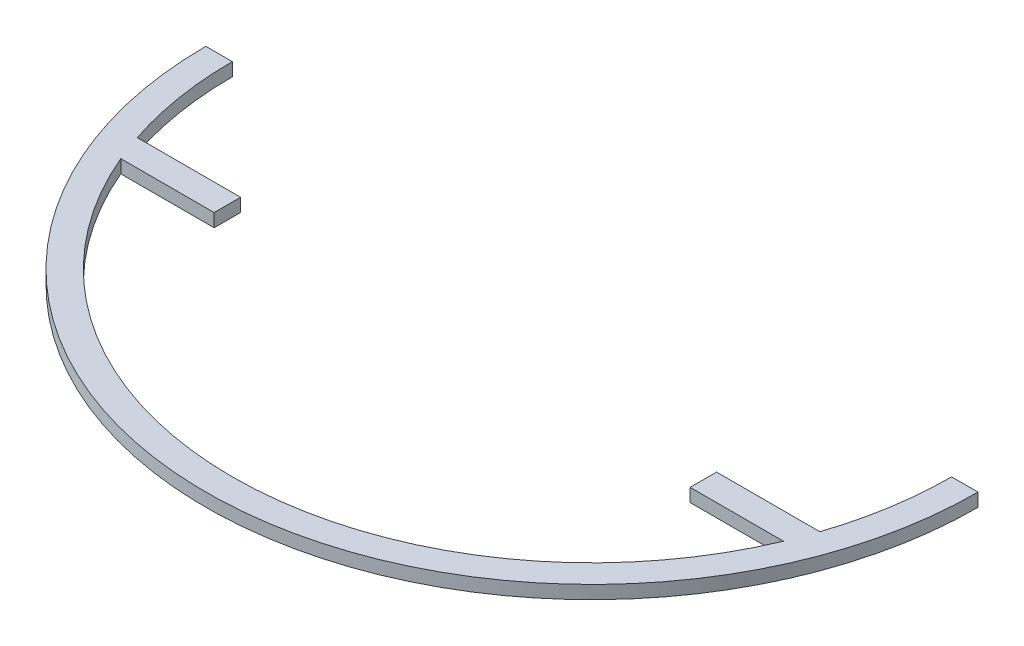
ISO-10303-21;
HEADER;
FILE_DESCRIPTION(('STEP AP214'),'2;1');
FILE_NAME('part.step','',(''),(''),'','','');
FILE_SCHEMA(('AUTOMOTIVE_DESIGN { 1 0 10303 214 1 1 1 1 }'));
ENDSEC;
DATA;
#1=APPLICATION_CONTEXT('core data for automotive mechanical design processes');
#2=APPLICATION_PROTOCOL_DEFINITION('international standard','automotive_design',2000,#1);
#3=PRODUCT_CONTEXT('',#1,'mechanical');
#4=PRODUCT('Part','Part','',(#3));
#5=PRODUCT_RELATED_PRODUCT_CATEGORY('part','',(#4));
#6=PRODUCT_DEFINITION_FORMATION('','',#4);
#7=PRODUCT_DEFINITION_CONTEXT('part definition',#1,'design');
#8=PRODUCT_DEFINITION('design','',#6,#7);
#9=PRODUCT_DEFINITION_SHAPE('','',#8);
#10=(LENGTH_UNIT() NAMED_UNIT(*) SI_UNIT(.MILLI.,.METRE.));
#11=(NAMED_UNIT(*) PLANE_ANGLE_UNIT() SI_UNIT($,.RADIAN.));
#12=(NAMED_UNIT(*) SI_UNIT($,.STERADIAN.) SOLID_ANGLE_UNIT());
#13=UNCERTAINTY_MEASURE_WITH_UNIT(LENGTH_MEASURE(1.E-05),#10,'distance_accuracy_value','');
#14=(GEOMETRIC_REPRESENTATION_CONTEXT(3) GLOBAL_UNCERTAINTY_ASSIGNED_CONTEXT((#13)) GLOBAL_UNIT_ASSIGNED_CONTEXT((#10,
#11,#12)) REPRESENTATION_CONTEXT('',''));
#15=CARTESIAN_POINT('',(0.,0.,0.));
#16=DIRECTION('',(0.,0.,1.));
#17=DIRECTION('',(1.,0.,0.));
#18=AXIS2_PLACEMENT_3D('',#15,#16,#17);
#19=CARTESIAN_POINT('',(0.,3.175,27.2204316815419));
#20=DIRECTION('',(0.,0.,-1.));
#21=DIRECTION('',(-1.,0.,0.));
#22=AXIS2_PLACEMENT_3D('',#19,#20,#21);
#23=PLANE('',#22);
#24=DIRECTION('',(1.,0.,0.));
#25=VECTOR('',#24,1.);
#26=CARTESIAN_POINT('',(0.,0.,27.2204316815419));
#27=LINE('',#26,#25);
#28=CARTESIAN_POINT('',(-81.9579019928556,0.,27.2204316815419));
#29=VERTEX_POINT('',#28);
#30=CARTESIAN_POINT('',(-57.15,0.,27.2204316815419));
#31=VERTEX_POINT('',#30);
#32=EDGE_CURVE('E197',#29,#31,#27,.T.);
#33=ORIENTED_EDGE('',*,*,#32,.F.);
#34=DIRECTION('',(0.,-1.,0.));
#35=VECTOR('',#34,1.);
#36=CARTESIAN_POINT('',(-81.9579019928556,3.175,27.2204316815419));
#37=LINE('',#36,#35);
#38=CARTESIAN_POINT('',(-81.9579019928556,3.175,27.2204316815419));
#39=VERTEX_POINT('',#38);
#40=EDGE_CURVE('E11',#39,#29,#37,.T.);
#41=ORIENTED_EDGE('',*,*,#40,.F.);
#42=DIRECTION('',(1.,0.,0.));
#43=VECTOR('',#42,1.);
#44=CARTESIAN_POINT('',(0.,3.175,27.2204316815419));
#45=LINE('',#44,#43);
#46=CARTESIAN_POINT('',(-57.15,3.175,27.2204316815419));
#47=VERTEX_POINT('',#46);
#48=EDGE_CURVE('E159',#39,#47,#45,.T.);
#49=ORIENTED_EDGE('',*,*,#48,.T.);
#50=DIRECTION('',(0.,-1.,0.));
#51=VECTOR('',#50,1.);
#52=CARTESIAN_POINT('',(-57.15,3.175,27.2204316815419));
#53=LINE('',#52,#51);
#54=EDGE_CURVE('E51',#47,#31,#53,.T.);
#55=ORIENTED_EDGE('',*,*,#54,.T.);
#56=EDGE_LOOP('',(#33,#41,#49,#55));
#57=FACE_BOUND('',#56,.T.);
#58=ADVANCED_FACE('F35',(#57),#23,.T.);
#59=CARTESIAN_POINT('',(0.,3.175,0.));
#60=DIRECTION('',(0.,-1.,0.));
#61=DIRECTION('',(0.,0.,-1.));
#62=AXIS2_PLACEMENT_3D('',#59,#60,#61);
#63=CYLINDRICAL_SURFACE('',#62,86.36);
#64=CARTESIAN_POINT('',(0.,0.,0.));
#65=DIRECTION('',(0.,1.,0.));
#66=DIRECTION('',(0.,0.,1.));
#67=AXIS2_PLACEMENT_3D('',#64,#65,#66);
#68=CIRCLE('',#67,86.36);
#69=CARTESIAN_POINT('',(-86.36,0.,0.));
#70=VERTEX_POINT('',#69);
#71=EDGE_CURVE('E195',#70,#29,#68,.T.);
#72=ORIENTED_EDGE('',*,*,#71,.F.);
#73=DIRECTION('',(0.,-1.,0.));
#74=VECTOR('',#73,1.);
#75=CARTESIAN_POINT('',(-86.36,3.175,0.));
#76=LINE('',#75,#74);
#77=CARTESIAN_POINT('',(-86.36,3.175,0.));
#78=VERTEX_POINT('',#77);
#79=EDGE_CURVE('E43',#78,#70,#76,.T.);
#80=ORIENTED_EDGE('',*,*,#79,.F.);
#81=CARTESIAN_POINT('',(0.,3.175,0.));
#82=DIRECTION('',(0.,1.,0.));
#83=DIRECTION('',(0.,0.,1.));
#84=AXIS2_PLACEMENT_3D('',#81,#82,#83);
#85=CIRCLE('',#84,86.36);
#86=EDGE_CURVE('E149',#78,#39,#85,.T.);
#87=ORIENTED_EDGE('',*,*,#86,.T.);
#88=ORIENTED_EDGE('',*,*,#40,.T.);
#89=EDGE_LOOP('',(#72,#80,#87,#88));
#90=FACE_BOUND('',#89,.T.);
#91=ADVANCED_FACE('F196',(#90),#63,.F.);
#92=CARTESIAN_POINT('',(0.,3.175,0.));
#93=DIRECTION('',(0.,0.,-1.));
#94=DIRECTION('',(-1.,0.,0.));
#95=AXIS2_PLACEMENT_3D('',#92,#93,#94);
#96=PLANE('',#95);
#97=DIRECTION('',(1.,0.,0.));
#98=VECTOR('',#97,1.);
#99=CARTESIAN_POINT('',(0.,0.,0.));
#100=LINE('',#99,#98);
#101=CARTESIAN_POINT('',(-92.71,0.,0.));
#102=VERTEX_POINT('',#101);
#103=EDGE_CURVE('E192',#102,#70,#100,.T.);
#104=ORIENTED_EDGE('',*,*,#103,.F.);
#105=DIRECTION('',(0.,-1.,0.));
#106=VECTOR('',#105,1.);
#107=CARTESIAN_POINT('',(-92.71,3.175,0.));
#108=LINE('',#107,#106);
#109=CARTESIAN_POINT('',(-92.71,3.175,0.));
#110=VERTEX_POINT('',#109);
#111=EDGE_CURVE('E186',#110,#102,#108,.T.);
#112=ORIENTED_EDGE('',*,*,#111,.F.);
#113=DIRECTION('',(1.,0.,0.));
#114=VECTOR('',#113,1.);
#115=CARTESIAN_POINT('',(0.,3.175,0.));
#116=LINE('',#115,#114);
#117=EDGE_CURVE('E158',#110,#78,#116,.T.);
#118=ORIENTED_EDGE('',*,*,#117,.T.);
#119=ORIENTED_EDGE('',*,*,#79,.T.);
#120=EDGE_LOOP('',(#104,#112,#118,#119));
#121=FACE_BOUND('',#120,.T.);
#122=ADVANCED_FACE('F190',(#121),#96,.T.);
#123=CARTESIAN_POINT('',(0.,3.175,0.));
#124=DIRECTION('',(0.,-1.,0.));
#125=DIRECTION('',(0.,0.,-1.));
#126=AXIS2_PLACEMENT_3D('',#123,#124,#125);
#127=CYLINDRICAL_SURFACE('',#126,92.71);
#128=CARTESIAN_POINT('',(0.,0.,0.));
#129=DIRECTION('',(0.,1.,0.));
#130=DIRECTION('',(0.,0.,1.));
#131=AXIS2_PLACEMENT_3D('',#128,#129,#130);
#132=CIRCLE('',#131,92.71);
#133=CARTESIAN_POINT('',(92.71,0.,0.));
#134=VERTEX_POINT('',#133);
#135=EDGE_CURVE('E204',#102,#134,#132,.T.);
#136=ORIENTED_EDGE('',*,*,#135,.T.);
#137=DIRECTION('',(0.,-1.,0.));
#138=VECTOR('',#137,1.);
#139=CARTESIAN_POINT('',(92.71,3.175,0.));
#140=LINE('',#139,#138);
#141=CARTESIAN_POINT('',(92.71,3.175,0.));
#142=VERTEX_POINT('',#141);
#143=EDGE_CURVE('E184',#142,#134,#140,.T.);
#144=ORIENTED_EDGE('',*,*,#143,.F.);
#145=CARTESIAN_POINT('',(0.,3.175,0.));
#146=DIRECTION('',(0.,1.,0.));
#147=DIRECTION('',(0.,0.,1.));
#148=AXIS2_PLACEMENT_3D('',#145,#146,#147);
#149=CIRCLE('',#148,92.71);
#150=EDGE_CURVE('E163',#110,#142,#149,.T.);
#151=ORIENTED_EDGE('',*,*,#150,.F.);
#152=ORIENTED_EDGE('',*,*,#111,.T.);
#153=EDGE_LOOP('',(#136,#144,#151,#152));
#154=FACE_BOUND('',#153,.T.);
#155=ADVANCED_FACE('F234',(#154),#127,.T.);
#156=CARTESIAN_POINT('',(0.,3.175,0.));
#157=DIRECTION('',(0.,0.,-1.));
#158=DIRECTION('',(-1.,0.,0.));
#159=AXIS2_PLACEMENT_3D('',#156,#157,#158);
#160=PLANE('',#159);
#161=DIRECTION('',(1.,0.,0.));
#162=VECTOR('',#161,1.);
#163=CARTESIAN_POINT('',(0.,0.,0.));
#164=LINE('',#163,#162);
#165=CARTESIAN_POINT('',(86.36,0.,0.));
#166=VERTEX_POINT('',#165);
#167=EDGE_CURVE('E206',#166,#134,#164,.T.);
#168=ORIENTED_EDGE('',*,*,#167,.F.);
#169=DIRECTION('',(0.,-1.,0.));
#170=VECTOR('',#169,1.);
#171=CARTESIAN_POINT('',(86.36,3.175,0.));
#172=LINE('',#171,#170);
#173=CARTESIAN_POINT('',(86.36,3.175,0.));
#174=VERTEX_POINT('',#173);
#175=EDGE_CURVE('E182',#174,#166,#172,.T.);
#176=ORIENTED_EDGE('',*,*,#175,.F.);
#177=DIRECTION('',(1.,0.,0.));
#178=VECTOR('',#177,1.);
#179=CARTESIAN_POINT('',(0.,3.175,0.));
#180=LINE('',#179,#178);
#181=EDGE_CURVE('E156',#174,#142,#180,.T.);
#182=ORIENTED_EDGE('',*,*,#181,.T.);
#183=ORIENTED_EDGE('',*,*,#143,.T.);
#184=EDGE_LOOP('',(#168,#176,#182,#183));
#185=FACE_BOUND('',#184,.T.);
#186=ADVANCED_FACE('F230',(#185),#160,.T.);
#187=CARTESIAN_POINT('',(81.9579019928556,0.,27.2204316815419));
#188=VERTEX_POINT('',#187);
#189=EDGE_CURVE('E199',#188,#166,#68,.T.);
#190=ORIENTED_EDGE('',*,*,#189,.F.);
#191=DIRECTION('',(0.,-1.,0.));
#192=VECTOR('',#191,1.);
#193=CARTESIAN_POINT('',(81.9579019928556,3.175,27.2204316815419));
#194=LINE('',#193,#192);
#195=CARTESIAN_POINT('',(81.9579019928556,3.175,27.2204316815419));
#196=VERTEX_POINT('',#195);
#197=EDGE_CURVE('E180',#196,#188,#194,.T.);
#198=ORIENTED_EDGE('',*,*,#197,.F.);
#199=EDGE_CURVE('E148',#196,#174,#85,.T.);
#200=ORIENTED_EDGE('',*,*,#199,.T.);
#201=ORIENTED_EDGE('',*,*,#175,.T.);
#202=EDGE_LOOP('',(#190,#198,#200,#201));
#203=FACE_BOUND('',#202,.T.);
#204=ADVANCED_FACE('F225',(#203),#63,.F.);
#205=CARTESIAN_POINT('',(0.,3.175,27.2204316815419));
#206=DIRECTION('',(0.,0.,-1.));
#207=DIRECTION('',(-1.,0.,0.));
#208=AXIS2_PLACEMENT_3D('',#205,#206,#207);
#209=PLANE('',#208);
#210=DIRECTION('',(1.,0.,0.));
#211=VECTOR('',#210,1.);
#212=CARTESIAN_POINT('',(0.,0.,27.2204316815419));
#213=LINE('',#212,#211);
#214=CARTESIAN_POINT('',(57.15,0.,27.2204316815419));
#215=VERTEX_POINT('',#214);
#216=EDGE_CURVE('E211',#215,#188,#213,.T.);
#217=ORIENTED_EDGE('',*,*,#216,.F.);
#218=DIRECTION('',(0.,-1.,0.));
#219=VECTOR('',#218,1.);
#220=CARTESIAN_POINT('',(57.15,3.175,27.2204316815419));
#221=LINE('',#220,#219);
#222=CARTESIAN_POINT('',(57.15,3.175,27.2204316815419));
#223=VERTEX_POINT('',#222);
#224=EDGE_CURVE('E178',#223,#215,#221,.T.);
#225=ORIENTED_EDGE('',*,*,#224,.F.);
#226=DIRECTION('',(1.,0.,0.));
#227=VECTOR('',#226,1.);
#228=CARTESIAN_POINT('',(0.,3.175,27.2204316815419));
#229=LINE('',#228,#227);
#230=EDGE_CURVE('E155',#223,#196,#229,.T.);
#231=ORIENTED_EDGE('',*,*,#230,.T.);
#232=ORIENTED_EDGE('',*,*,#197,.T.);
#233=EDGE_LOOP('',(#217,#225,#231,#232));
#234=FACE_BOUND('',#233,.T.);
#235=ADVANCED_FACE('F257',(#234),#209,.T.);
#236=CARTESIAN_POINT('',(57.15,3.175,0.));
#237=DIRECTION('',(1.,0.,0.));
#238=DIRECTION('',(0.,0.,-1.));
#239=AXIS2_PLACEMENT_3D('',#236,#237,#238);
#240=PLANE('',#239);
#241=DIRECTION('',(0.,0.,1.));
#242=VECTOR('',#241,1.);
#243=CARTESIAN_POINT('',(57.15,0.,0.));
#244=LINE('',#243,#242);
#245=CARTESIAN_POINT('',(57.15,0.,33.5704316815419));
#246=VERTEX_POINT('',#245);
#247=EDGE_CURVE('E214',#215,#246,#244,.T.);
#248=ORIENTED_EDGE('',*,*,#247,.T.);
#249=DIRECTION('',(0.,-1.,0.));
#250=VECTOR('',#249,1.);
#251=CARTESIAN_POINT('',(57.15,3.175,33.5704316815419));
#252=LINE('',#251,#250);
#253=CARTESIAN_POINT('',(57.15,3.175,33.5704316815419));
#254=VERTEX_POINT('',#253);
#255=EDGE_CURVE('E175',#254,#246,#252,.T.);
#256=ORIENTED_EDGE('',*,*,#255,.F.);
#257=DIRECTION('',(0.,0.,1.));
#258=VECTOR('',#257,1.);
#259=CARTESIAN_POINT('',(57.15,3.175,0.));
#260=LINE('',#259,#258);
#261=EDGE_CURVE('E150',#223,#254,#260,.T.);
#262=ORIENTED_EDGE('',*,*,#261,.F.);
#263=ORIENTED_EDGE('',*,*,#224,.T.);
#264=EDGE_LOOP('',(#248,#256,#262,#263));
#265=FACE_BOUND('',#264,.T.);
#266=ADVANCED_FACE('F263',(#265),#240,.F.);
#267=CARTESIAN_POINT('',(0.,3.175,33.5704316815419));
#268=DIRECTION('',(0.,0.,-1.));
#269=DIRECTION('',(-1.,0.,0.));
#270=AXIS2_PLACEMENT_3D('',#267,#268,#269);
#271=PLANE('',#270);
#272=DIRECTION('',(1.,0.,0.));
#273=VECTOR('',#272,1.);
#274=CARTESIAN_POINT('',(0.,0.,33.5704316815419));
#275=LINE('',#274,#273);
#276=CARTESIAN_POINT('',(79.5680571379931,0.,33.5704316815419));
#277=VERTEX_POINT('',#276);
#278=EDGE_CURVE('E215',#246,#277,#275,.T.);
#279=ORIENTED_EDGE('',*,*,#278,.T.);
#280=DIRECTION('',(0.,-1.,0.));
#281=VECTOR('',#280,1.);
#282=CARTESIAN_POINT('',(79.5680571379931,3.175,33.5704316815419));
#283=LINE('',#282,#281);
#284=CARTESIAN_POINT('',(79.5680571379931,3.175,33.5704316815419));
#285=VERTEX_POINT('',#284);
#286=EDGE_CURVE('E135',#285,#277,#283,.T.);
#287=ORIENTED_EDGE('',*,*,#286,.F.);
#288=DIRECTION('',(1.,0.,0.));
#289=VECTOR('',#288,1.);
#290=CARTESIAN_POINT('',(0.,3.175,33.5704316815419));
#291=LINE('',#290,#289);
#292=EDGE_CURVE('E145',#254,#285,#291,.T.);
#293=ORIENTED_EDGE('',*,*,#292,.F.);
#294=ORIENTED_EDGE('',*,*,#255,.T.);
#295=EDGE_LOOP('',(#279,#287,#293,#294));
#296=FACE_BOUND('',#295,.T.);
#297=ADVANCED_FACE('F259',(#296),#271,.F.);
#298=CARTESIAN_POINT('',(-79.5680571379931,0.,33.5704316815419));
#299=VERTEX_POINT('',#298);
#300=EDGE_CURVE('E132',#299,#277,#68,.T.);
#301=ORIENTED_EDGE('',*,*,#300,.F.);
#302=DIRECTION('',(0.,-1.,0.));
#303=VECTOR('',#302,1.);
#304=CARTESIAN_POINT('',(-79.5680571379931,3.175,33.5704316815419));
#305=LINE('',#304,#303);
#306=CARTESIAN_POINT('',(-79.5680571379931,3.175,33.5704316815419));
#307=VERTEX_POINT('',#306);
#308=EDGE_CURVE('E126',#307,#299,#305,.T.);
#309=ORIENTED_EDGE('',*,*,#308,.F.);
#310=EDGE_CURVE('E130',#307,#285,#85,.T.);
#311=ORIENTED_EDGE('',*,*,#310,.T.);
#312=ORIENTED_EDGE('',*,*,#286,.T.);
#313=EDGE_LOOP('',(#301,#309,#311,#312));
#314=FACE_BOUND('',#313,.T.);
#315=ADVANCED_FACE('F128',(#314),#63,.F.);
#316=CARTESIAN_POINT('',(0.,3.175,33.5704316815419));
#317=DIRECTION('',(0.,0.,-1.));
#318=DIRECTION('',(-1.,0.,0.));
#319=AXIS2_PLACEMENT_3D('',#316,#317,#318);
#320=PLANE('',#319);
#321=DIRECTION('',(1.,0.,0.));
#322=VECTOR('',#321,1.);
#323=CARTESIAN_POINT('',(0.,0.,33.5704316815419));
#324=LINE('',#323,#322);
#325=CARTESIAN_POINT('',(-57.15,0.,33.5704316815419));
#326=VERTEX_POINT('',#325);
#327=EDGE_CURVE('E166',#299,#326,#324,.T.);
#328=ORIENTED_EDGE('',*,*,#327,.T.);
#329=DIRECTION('',(0.,-1.,0.));
#330=VECTOR('',#329,1.);
#331=CARTESIAN_POINT('',(-57.15,3.175,33.5704316815419));
#332=LINE('',#331,#330);
#333=CARTESIAN_POINT('',(-57.15,3.175,33.5704316815419));
#334=VERTEX_POINT('',#333);
#335=EDGE_CURVE('E89',#334,#326,#332,.T.);
#336=ORIENTED_EDGE('',*,*,#335,.F.);
#337=DIRECTION('',(1.,0.,0.));
#338=VECTOR('',#337,1.);
#339=CARTESIAN_POINT('',(0.,3.175,33.5704316815419));
#340=LINE('',#339,#338);
#341=EDGE_CURVE('E137',#307,#334,#340,.T.);
#342=ORIENTED_EDGE('',*,*,#341,.F.);
#343=ORIENTED_EDGE('',*,*,#308,.T.);
#344=EDGE_LOOP('',(#328,#336,#342,#343));
#345=FACE_BOUND('',#344,.T.);
#346=ADVANCED_FACE('F138',(#345),#320,.F.);
#347=CARTESIAN_POINT('',(-57.15,3.175,0.));
#348=DIRECTION('',(1.,0.,0.));
#349=DIRECTION('',(0.,0.,-1.));
#350=AXIS2_PLACEMENT_3D('',#347,#348,#349);
#351=PLANE('',#350);
#352=DIRECTION('',(0.,0.,1.));
#353=VECTOR('',#352,1.);
#354=CARTESIAN_POINT('',(-57.15,0.,0.));
#355=LINE('',#354,#353);
#356=EDGE_CURVE('E164',#31,#326,#355,.T.);
#357=ORIENTED_EDGE('',*,*,#356,.F.);
#358=ORIENTED_EDGE('',*,*,#54,.F.);
#359=DIRECTION('',(0.,0.,1.));
#360=VECTOR('',#359,1.);
#361=CARTESIAN_POINT('',(-57.15,3.175,0.));
#362=LINE('',#361,#360);
#363=EDGE_CURVE('E141',#47,#334,#362,.T.);
#364=ORIENTED_EDGE('',*,*,#363,.T.);
#365=ORIENTED_EDGE('',*,*,#335,.T.);
#366=EDGE_LOOP('',(#357,#358,#364,#365));
#367=FACE_BOUND('',#366,.T.);
#368=ADVANCED_FACE('F237',(#367),#351,.T.);
#369=CARTESIAN_POINT('',(0.,3.175,0.));
#370=DIRECTION('',(0.,1.,0.));
#371=DIRECTION('',(0.,0.,1.));
#372=AXIS2_PLACEMENT_3D('',#369,#370,#371);
#373=PLANE('',#372);
#374=ORIENTED_EDGE('',*,*,#48,.F.);
#375=ORIENTED_EDGE('',*,*,#86,.F.);
#376=ORIENTED_EDGE('',*,*,#117,.F.);
#377=ORIENTED_EDGE('',*,*,#150,.T.);
#378=ORIENTED_EDGE('',*,*,#181,.F.);
#379=ORIENTED_EDGE('',*,*,#199,.F.);
#380=ORIENTED_EDGE('',*,*,#230,.F.);
#381=ORIENTED_EDGE('',*,*,#261,.T.);
#382=ORIENTED_EDGE('',*,*,#292,.T.);
#383=ORIENTED_EDGE('',*,*,#310,.F.);
#384=ORIENTED_EDGE('',*,*,#341,.T.);
#385=ORIENTED_EDGE('',*,*,#363,.F.);
#386=EDGE_LOOP('',(#374,#375,#376,#377,#378,#379,#380,#381,#382,#383,#384,#385));
#387=FACE_BOUND('',#386,.T.);
#388=ADVANCED_FACE('F143',(#387),#373,.T.);
#389=CARTESIAN_POINT('',(0.,0.,0.));
#390=DIRECTION('',(0.,1.,0.));
#391=DIRECTION('',(0.,0.,1.));
#392=AXIS2_PLACEMENT_3D('',#389,#390,#391);
#393=PLANE('',#392);
#394=ORIENTED_EDGE('',*,*,#32,.T.);
#395=ORIENTED_EDGE('',*,*,#356,.T.);
#396=ORIENTED_EDGE('',*,*,#327,.F.);
#397=ORIENTED_EDGE('',*,*,#300,.T.);
#398=ORIENTED_EDGE('',*,*,#278,.F.);
#399=ORIENTED_EDGE('',*,*,#247,.F.);
#400=ORIENTED_EDGE('',*,*,#216,.T.);
#401=ORIENTED_EDGE('',*,*,#189,.T.);
#402=ORIENTED_EDGE('',*,*,#167,.T.);
#403=ORIENTED_EDGE('',*,*,#135,.F.);
#404=ORIENTED_EDGE('',*,*,#103,.T.);
#405=ORIENTED_EDGE('',*,*,#71,.T.);
#406=EDGE_LOOP('',(#394,#395,#396,#397,#398,#399,#400,#401,#402,#403,#404,#405));
#407=FACE_BOUND('',#406,.T.);
#408=ADVANCED_FACE('F201',(#407),#393,.F.);
#409=CLOSED_SHELL('',(#58,#91,#122,#155,#186,#204,#235,#266,#297,#315,#346,#368,#388,#408));
#410=MANIFOLD_SOLID_BREP('B2',#409);
#411=ADVANCED_BREP_SHAPE_REPRESENTATION('',(#18,#410),#14);
#412=SHAPE_DEFINITION_REPRESENTATION(#9,#411);
ENDSEC;
END-ISO-10303-21;
